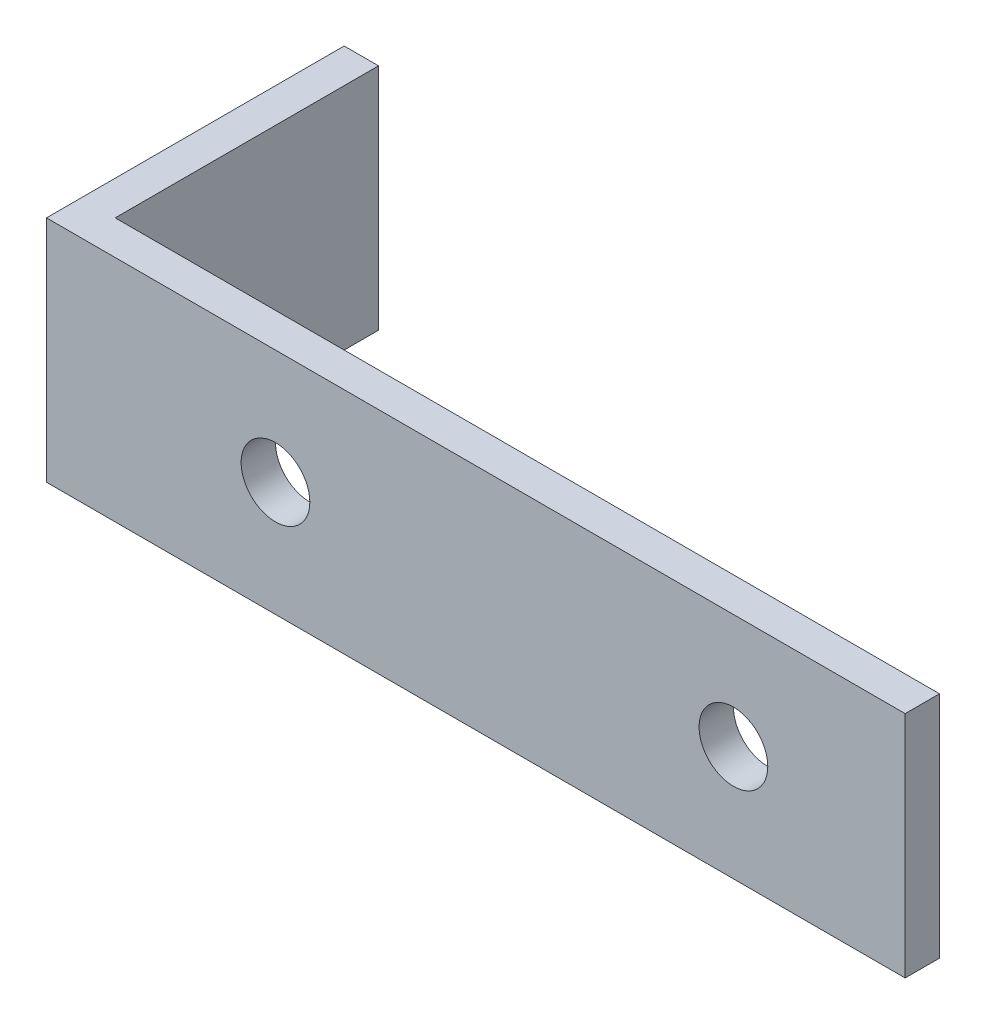
ISO-10303-21;
HEADER;
FILE_DESCRIPTION(('STEP AP214'),'2;1');
FILE_NAME('part.step','',(''),(''),'','','');
FILE_SCHEMA(('AUTOMOTIVE_DESIGN { 1 0 10303 214 1 1 1 1 }'));
ENDSEC;
DATA;
#1=APPLICATION_CONTEXT('core data for automotive mechanical design processes');
#2=APPLICATION_PROTOCOL_DEFINITION('international standard','automotive_design',2000,#1);
#3=PRODUCT_CONTEXT('',#1,'mechanical');
#4=PRODUCT('Part','Part','',(#3));
#5=PRODUCT_RELATED_PRODUCT_CATEGORY('part','',(#4));
#6=PRODUCT_DEFINITION_FORMATION('','',#4);
#7=PRODUCT_DEFINITION_CONTEXT('part definition',#1,'design');
#8=PRODUCT_DEFINITION('design','',#6,#7);
#9=PRODUCT_DEFINITION_SHAPE('','',#8);
#10=(LENGTH_UNIT() NAMED_UNIT(*) SI_UNIT(.MILLI.,.METRE.));
#11=(NAMED_UNIT(*) PLANE_ANGLE_UNIT() SI_UNIT($,.RADIAN.));
#12=(NAMED_UNIT(*) SI_UNIT($,.STERADIAN.) SOLID_ANGLE_UNIT());
#13=UNCERTAINTY_MEASURE_WITH_UNIT(LENGTH_MEASURE(1.E-05),#10,'distance_accuracy_value','');
#14=(GEOMETRIC_REPRESENTATION_CONTEXT(3) GLOBAL_UNCERTAINTY_ASSIGNED_CONTEXT((#13)) GLOBAL_UNIT_ASSIGNED_CONTEXT((#10,
#11,#12)) REPRESENTATION_CONTEXT('',''));
#15=CARTESIAN_POINT('',(0.,0.,0.));
#16=DIRECTION('',(0.,0.,1.));
#17=DIRECTION('',(1.,0.,0.));
#18=AXIS2_PLACEMENT_3D('',#15,#16,#17);
#19=CARTESIAN_POINT('',(0.,0.,3.));
#20=DIRECTION('',(0.,1.,0.));
#21=DIRECTION('',(0.,0.,1.));
#22=AXIS2_PLACEMENT_3D('',#19,#20,#21);
#23=PLANE('',#22);
#24=DIRECTION('',(0.,0.,-1.));
#25=VECTOR('',#24,1.);
#26=CARTESIAN_POINT('',(0.,0.,3.));
#27=LINE('',#26,#25);
#28=CARTESIAN_POINT('',(0.,0.,3.));
#29=VERTEX_POINT('',#28);
#30=CARTESIAN_POINT('',(0.,0.,-23.));
#31=VERTEX_POINT('',#30);
#32=EDGE_CURVE('E66',#29,#31,#27,.T.);
#33=ORIENTED_EDGE('',*,*,#32,.T.);
#34=DIRECTION('',(1.,0.,0.));
#35=VECTOR('',#34,1.);
#36=CARTESIAN_POINT('',(0.,0.,-23.));
#37=LINE('',#36,#35);
#38=CARTESIAN_POINT('',(3.,0.,-23.));
#39=VERTEX_POINT('',#38);
#40=EDGE_CURVE('E118',#31,#39,#37,.T.);
#41=ORIENTED_EDGE('',*,*,#40,.T.);
#42=DIRECTION('',(0.,0.,1.));
#43=VECTOR('',#42,1.);
#44=CARTESIAN_POINT('',(3.,0.,-23.));
#45=LINE('',#44,#43);
#46=CARTESIAN_POINT('',(3.,0.,0.));
#47=VERTEX_POINT('',#46);
#48=EDGE_CURVE('E104',#39,#47,#45,.T.);
#49=ORIENTED_EDGE('',*,*,#48,.T.);
#50=DIRECTION('',(1.,0.,0.));
#51=VECTOR('',#50,1.);
#52=CARTESIAN_POINT('',(0.,0.,0.));
#53=LINE('',#52,#51);
#54=CARTESIAN_POINT('',(75.,0.,0.));
#55=VERTEX_POINT('',#54);
#56=EDGE_CURVE('E127',#47,#55,#53,.T.);
#57=ORIENTED_EDGE('',*,*,#56,.T.);
#58=DIRECTION('',(0.,0.,-1.));
#59=VECTOR('',#58,1.);
#60=CARTESIAN_POINT('',(75.,0.,3.));
#61=LINE('',#60,#59);
#62=CARTESIAN_POINT('',(75.,0.,3.));
#63=VERTEX_POINT('',#62);
#64=EDGE_CURVE('E11',#63,#55,#61,.T.);
#65=ORIENTED_EDGE('',*,*,#64,.F.);
#66=DIRECTION('',(1.,0.,0.));
#67=VECTOR('',#66,1.);
#68=CARTESIAN_POINT('',(0.,0.,3.));
#69=LINE('',#68,#67);
#70=EDGE_CURVE('E129',#29,#63,#69,.T.);
#71=ORIENTED_EDGE('',*,*,#70,.F.);
#72=EDGE_LOOP('',(#33,#41,#49,#57,#65,#71));
#73=FACE_BOUND('',#72,.T.);
#74=ADVANCED_FACE('F43',(#73),#23,.F.);
#75=CARTESIAN_POINT('',(75.,0.,3.));
#76=DIRECTION('',(-1.,0.,0.));
#77=DIRECTION('',(0.,0.,1.));
#78=AXIS2_PLACEMENT_3D('',#75,#76,#77);
#79=PLANE('',#78);
#80=DIRECTION('',(0.,1.,0.));
#81=VECTOR('',#80,1.);
#82=CARTESIAN_POINT('',(75.,0.,0.));
#83=LINE('',#82,#81);
#84=CARTESIAN_POINT('',(75.,20.,0.));
#85=VERTEX_POINT('',#84);
#86=EDGE_CURVE('E145',#55,#85,#83,.T.);
#87=ORIENTED_EDGE('',*,*,#86,.T.);
#88=DIRECTION('',(0.,0.,-1.));
#89=VECTOR('',#88,1.);
#90=CARTESIAN_POINT('',(75.,20.,3.));
#91=LINE('',#90,#89);
#92=CARTESIAN_POINT('',(75.,20.,3.));
#93=VERTEX_POINT('',#92);
#94=EDGE_CURVE('E50',#93,#85,#91,.T.);
#95=ORIENTED_EDGE('',*,*,#94,.F.);
#96=DIRECTION('',(0.,1.,0.));
#97=VECTOR('',#96,1.);
#98=CARTESIAN_POINT('',(75.,0.,3.));
#99=LINE('',#98,#97);
#100=EDGE_CURVE('E89',#63,#93,#99,.T.);
#101=ORIENTED_EDGE('',*,*,#100,.F.);
#102=ORIENTED_EDGE('',*,*,#64,.T.);
#103=EDGE_LOOP('',(#87,#95,#101,#102));
#104=FACE_BOUND('',#103,.T.);
#105=ADVANCED_FACE('F159',(#104),#79,.F.);
#106=CARTESIAN_POINT('',(0.,20.,3.));
#107=DIRECTION('',(0.,1.,0.));
#108=DIRECTION('',(0.,0.,1.));
#109=AXIS2_PLACEMENT_3D('',#106,#107,#108);
#110=PLANE('',#109);
#111=DIRECTION('',(1.,0.,0.));
#112=VECTOR('',#111,1.);
#113=CARTESIAN_POINT('',(0.,20.,0.));
#114=LINE('',#113,#112);
#115=CARTESIAN_POINT('',(3.,20.,0.));
#116=VERTEX_POINT('',#115);
#117=EDGE_CURVE('E82',#116,#85,#114,.T.);
#118=ORIENTED_EDGE('',*,*,#117,.F.);
#119=DIRECTION('',(0.,0.,1.));
#120=VECTOR('',#119,1.);
#121=CARTESIAN_POINT('',(3.,20.,-23.));
#122=LINE('',#121,#120);
#123=CARTESIAN_POINT('',(3.,20.,-23.));
#124=VERTEX_POINT('',#123);
#125=EDGE_CURVE('E57',#124,#116,#122,.T.);
#126=ORIENTED_EDGE('',*,*,#125,.F.);
#127=DIRECTION('',(1.,0.,0.));
#128=VECTOR('',#127,1.);
#129=CARTESIAN_POINT('',(0.,20.,-23.));
#130=LINE('',#129,#128);
#131=CARTESIAN_POINT('',(0.,20.,-23.));
#132=VERTEX_POINT('',#131);
#133=EDGE_CURVE('E120',#132,#124,#130,.T.);
#134=ORIENTED_EDGE('',*,*,#133,.F.);
#135=DIRECTION('',(0.,0.,-1.));
#136=VECTOR('',#135,1.);
#137=CARTESIAN_POINT('',(0.,20.,3.));
#138=LINE('',#137,#136);
#139=CARTESIAN_POINT('',(0.,20.,3.));
#140=VERTEX_POINT('',#139);
#141=EDGE_CURVE('E155',#140,#132,#138,.T.);
#142=ORIENTED_EDGE('',*,*,#141,.F.);
#143=DIRECTION('',(1.,0.,0.));
#144=VECTOR('',#143,1.);
#145=CARTESIAN_POINT('',(0.,20.,3.));
#146=LINE('',#145,#144);
#147=EDGE_CURVE('E133',#140,#93,#146,.T.);
#148=ORIENTED_EDGE('',*,*,#147,.T.);
#149=ORIENTED_EDGE('',*,*,#94,.T.);
#150=EDGE_LOOP('',(#118,#126,#134,#142,#148,#149));
#151=FACE_BOUND('',#150,.T.);
#152=ADVANCED_FACE('F157',(#151),#110,.T.);
#153=CARTESIAN_POINT('',(20.,10.,3.));
#154=DIRECTION('',(0.,0.,-1.));
#155=DIRECTION('',(-1.,0.,0.));
#156=AXIS2_PLACEMENT_3D('',#153,#154,#155);
#157=CYLINDRICAL_SURFACE('',#156,3.);
#158=CARTESIAN_POINT('',(20.,10.,3.));
#159=DIRECTION('',(0.,0.,1.));
#160=DIRECTION('',(1.,0.,0.));
#161=AXIS2_PLACEMENT_3D('',#158,#159,#160);
#162=CIRCLE('',#161,3.);
#163=CARTESIAN_POINT('',(23.,10.,3.));
#164=VERTEX_POINT('',#163);
#165=EDGE_CURVE('E138',#164,#164,#162,.T.);
#166=ORIENTED_EDGE('',*,*,#165,.T.);
#167=EDGE_LOOP('',(#166));
#168=FACE_BOUND('',#167,.T.);
#169=CARTESIAN_POINT('',(20.,10.,0.));
#170=DIRECTION('',(0.,0.,1.));
#171=DIRECTION('',(1.,0.,0.));
#172=AXIS2_PLACEMENT_3D('',#169,#170,#171);
#173=CIRCLE('',#172,3.);
#174=CARTESIAN_POINT('',(23.,10.,0.));
#175=VERTEX_POINT('',#174);
#176=EDGE_CURVE('E149',#175,#175,#173,.T.);
#177=ORIENTED_EDGE('',*,*,#176,.F.);
#178=EDGE_LOOP('',(#177));
#179=FACE_BOUND('',#178,.T.);
#180=ADVANCED_FACE('F170',(#168,#179),#157,.F.);
#181=CARTESIAN_POINT('',(0.,0.,3.));
#182=DIRECTION('',(-1.,0.,0.));
#183=DIRECTION('',(0.,0.,1.));
#184=AXIS2_PLACEMENT_3D('',#181,#182,#183);
#185=PLANE('',#184);
#186=ORIENTED_EDGE('',*,*,#141,.T.);
#187=DIRECTION('',(0.,1.,0.));
#188=VECTOR('',#187,1.);
#189=CARTESIAN_POINT('',(0.,0.,-23.));
#190=LINE('',#189,#188);
#191=EDGE_CURVE('E112',#31,#132,#190,.T.);
#192=ORIENTED_EDGE('',*,*,#191,.F.);
#193=ORIENTED_EDGE('',*,*,#32,.F.);
#194=DIRECTION('',(0.,1.,0.));
#195=VECTOR('',#194,1.);
#196=CARTESIAN_POINT('',(0.,0.,3.));
#197=LINE('',#196,#195);
#198=EDGE_CURVE('E136',#29,#140,#197,.T.);
#199=ORIENTED_EDGE('',*,*,#198,.T.);
#200=EDGE_LOOP('',(#186,#192,#193,#199));
#201=FACE_BOUND('',#200,.T.);
#202=ADVANCED_FACE('F167',(#201),#185,.T.);
#203=CARTESIAN_POINT('',(60.,10.,3.));
#204=DIRECTION('',(0.,0.,-1.));
#205=DIRECTION('',(-1.,0.,0.));
#206=AXIS2_PLACEMENT_3D('',#203,#204,#205);
#207=CYLINDRICAL_SURFACE('',#206,3.00000000000001);
#208=CARTESIAN_POINT('',(60.,10.,3.));
#209=DIRECTION('',(0.,0.,1.));
#210=DIRECTION('',(1.,0.,0.));
#211=AXIS2_PLACEMENT_3D('',#208,#209,#210);
#212=CIRCLE('',#211,3.00000000000001);
#213=CARTESIAN_POINT('',(63.,10.,3.));
#214=VERTEX_POINT('',#213);
#215=EDGE_CURVE('E141',#214,#214,#212,.T.);
#216=ORIENTED_EDGE('',*,*,#215,.T.);
#217=EDGE_LOOP('',(#216));
#218=FACE_BOUND('',#217,.T.);
#219=CARTESIAN_POINT('',(60.,10.,0.));
#220=DIRECTION('',(0.,0.,1.));
#221=DIRECTION('',(1.,0.,0.));
#222=AXIS2_PLACEMENT_3D('',#219,#220,#221);
#223=CIRCLE('',#222,3.00000000000001);
#224=CARTESIAN_POINT('',(63.,10.,0.));
#225=VERTEX_POINT('',#224);
#226=EDGE_CURVE('E131',#225,#225,#223,.T.);
#227=ORIENTED_EDGE('',*,*,#226,.F.);
#228=EDGE_LOOP('',(#227));
#229=FACE_BOUND('',#228,.T.);
#230=ADVANCED_FACE('F169',(#218,#229),#207,.F.);
#231=CARTESIAN_POINT('',(0.,0.,3.));
#232=DIRECTION('',(0.,0.,1.));
#233=DIRECTION('',(1.,0.,0.));
#234=AXIS2_PLACEMENT_3D('',#231,#232,#233);
#235=PLANE('',#234);
#236=ORIENTED_EDGE('',*,*,#70,.T.);
#237=ORIENTED_EDGE('',*,*,#100,.T.);
#238=ORIENTED_EDGE('',*,*,#147,.F.);
#239=ORIENTED_EDGE('',*,*,#198,.F.);
#240=EDGE_LOOP('',(#236,#237,#238,#239));
#241=FACE_BOUND('',#240,.T.);
#242=ORIENTED_EDGE('',*,*,#165,.F.);
#243=EDGE_LOOP('',(#242));
#244=FACE_BOUND('',#243,.T.);
#245=ORIENTED_EDGE('',*,*,#215,.F.);
#246=EDGE_LOOP('',(#245));
#247=FACE_BOUND('',#246,.T.);
#248=ADVANCED_FACE('F165',(#241,#244,#247),#235,.T.);
#249=CARTESIAN_POINT('',(0.,0.,0.));
#250=DIRECTION('',(0.,0.,1.));
#251=DIRECTION('',(1.,0.,0.));
#252=AXIS2_PLACEMENT_3D('',#249,#250,#251);
#253=PLANE('',#252);
#254=ORIENTED_EDGE('',*,*,#56,.F.);
#255=DIRECTION('',(0.,1.,0.));
#256=VECTOR('',#255,1.);
#257=CARTESIAN_POINT('',(3.,0.,0.));
#258=LINE('',#257,#256);
#259=EDGE_CURVE('E108',#47,#116,#258,.T.);
#260=ORIENTED_EDGE('',*,*,#259,.T.);
#261=ORIENTED_EDGE('',*,*,#117,.T.);
#262=ORIENTED_EDGE('',*,*,#86,.F.);
#263=EDGE_LOOP('',(#254,#260,#261,#262));
#264=FACE_BOUND('',#263,.T.);
#265=ORIENTED_EDGE('',*,*,#176,.T.);
#266=EDGE_LOOP('',(#265));
#267=FACE_BOUND('',#266,.T.);
#268=ORIENTED_EDGE('',*,*,#226,.T.);
#269=EDGE_LOOP('',(#268));
#270=FACE_BOUND('',#269,.T.);
#271=ADVANCED_FACE('F161',(#264,#267,#270),#253,.F.);
#272=CARTESIAN_POINT('',(3.,0.,-23.));
#273=DIRECTION('',(1.,0.,0.));
#274=DIRECTION('',(0.,0.,-1.));
#275=AXIS2_PLACEMENT_3D('',#272,#273,#274);
#276=PLANE('',#275);
#277=ORIENTED_EDGE('',*,*,#259,.F.);
#278=ORIENTED_EDGE('',*,*,#48,.F.);
#279=DIRECTION('',(0.,1.,0.));
#280=VECTOR('',#279,1.);
#281=CARTESIAN_POINT('',(3.,0.,-23.));
#282=LINE('',#281,#280);
#283=EDGE_CURVE('E107',#39,#124,#282,.T.);
#284=ORIENTED_EDGE('',*,*,#283,.T.);
#285=ORIENTED_EDGE('',*,*,#125,.T.);
#286=EDGE_LOOP('',(#277,#278,#284,#285));
#287=FACE_BOUND('',#286,.T.);
#288=ADVANCED_FACE('F106',(#287),#276,.T.);
#289=CARTESIAN_POINT('',(0.,0.,-23.));
#290=DIRECTION('',(0.,0.,1.));
#291=DIRECTION('',(1.,0.,0.));
#292=AXIS2_PLACEMENT_3D('',#289,#290,#291);
#293=PLANE('',#292);
#294=ORIENTED_EDGE('',*,*,#40,.F.);
#295=ORIENTED_EDGE('',*,*,#191,.T.);
#296=ORIENTED_EDGE('',*,*,#133,.T.);
#297=ORIENTED_EDGE('',*,*,#283,.F.);
#298=EDGE_LOOP('',(#294,#295,#296,#297));
#299=FACE_BOUND('',#298,.T.);
#300=ADVANCED_FACE('F116',(#299),#293,.F.);
#301=CLOSED_SHELL('',(#74,#105,#152,#180,#202,#230,#248,#271,#288,#300));
#302=MANIFOLD_SOLID_BREP('B2',#301);
#303=ADVANCED_BREP_SHAPE_REPRESENTATION('',(#18,#302),#14);
#304=SHAPE_DEFINITION_REPRESENTATION(#9,#303);
ENDSEC;
END-ISO-10303-21;
